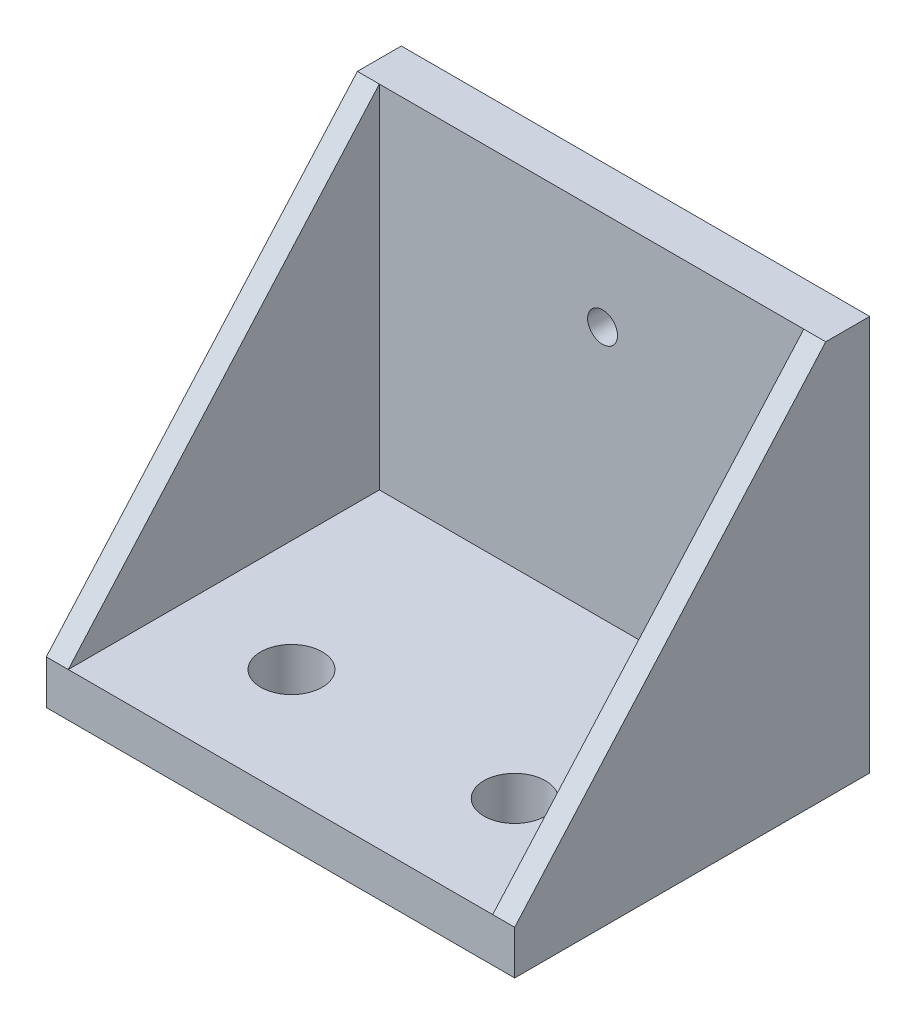
ISO-10303-21;
HEADER;
FILE_DESCRIPTION(('STEP AP214'),'2;1');
FILE_NAME('part.step','',(''),(''),'','','');
FILE_SCHEMA(('AUTOMOTIVE_DESIGN { 1 0 10303 214 1 1 1 1 }'));
ENDSEC;
DATA;
#1=APPLICATION_CONTEXT('core data for automotive mechanical design processes');
#2=APPLICATION_PROTOCOL_DEFINITION('international standard','automotive_design',2000,#1);
#3=PRODUCT_CONTEXT('',#1,'mechanical');
#4=PRODUCT('Part','Part','',(#3));
#5=PRODUCT_RELATED_PRODUCT_CATEGORY('part','',(#4));
#6=PRODUCT_DEFINITION_FORMATION('','',#4);
#7=PRODUCT_DEFINITION_CONTEXT('part definition',#1,'design');
#8=PRODUCT_DEFINITION('design','',#6,#7);
#9=PRODUCT_DEFINITION_SHAPE('','',#8);
#10=(LENGTH_UNIT() NAMED_UNIT(*) SI_UNIT(.MILLI.,.METRE.));
#11=(NAMED_UNIT(*) PLANE_ANGLE_UNIT() SI_UNIT($,.RADIAN.));
#12=(NAMED_UNIT(*) SI_UNIT($,.STERADIAN.) SOLID_ANGLE_UNIT());
#13=UNCERTAINTY_MEASURE_WITH_UNIT(LENGTH_MEASURE(1.E-05),#10,'distance_accuracy_value','');
#14=(GEOMETRIC_REPRESENTATION_CONTEXT(3) GLOBAL_UNCERTAINTY_ASSIGNED_CONTEXT((#13)) GLOBAL_UNIT_ASSIGNED_CONTEXT((#10,
#11,#12)) REPRESENTATION_CONTEXT('',''));
#15=CARTESIAN_POINT('',(0.,0.,0.));
#16=DIRECTION('',(0.,0.,1.));
#17=DIRECTION('',(1.,0.,0.));
#18=AXIS2_PLACEMENT_3D('',#15,#16,#17);
#19=CARTESIAN_POINT('',(0.,5.,0.));
#20=DIRECTION('',(0.,1.,0.));
#21=DIRECTION('',(0.,0.,1.));
#22=AXIS2_PLACEMENT_3D('',#19,#20,#21);
#23=PLANE('',#22);
#24=DIRECTION('',(0.,0.,1.));
#25=VECTOR('',#24,1.);
#26=CARTESIAN_POINT('',(-2.5,5.,0.));
#27=LINE('',#26,#25);
#28=CARTESIAN_POINT('',(-2.5,5.,-35.4));
#29=VERTEX_POINT('',#28);
#30=CARTESIAN_POINT('',(-2.5,5.,0.));
#31=VERTEX_POINT('',#30);
#32=EDGE_CURVE('E159',#29,#31,#27,.T.);
#33=ORIENTED_EDGE('',*,*,#32,.F.);
#34=DIRECTION('',(-1.,0.,0.));
#35=VECTOR('',#34,1.);
#36=CARTESIAN_POINT('',(-50.8,5.,-35.4));
#37=LINE('',#36,#35);
#38=CARTESIAN_POINT('',(-50.8,5.,-35.4));
#39=VERTEX_POINT('',#38);
#40=EDGE_CURVE('E53',#29,#39,#37,.T.);
#41=ORIENTED_EDGE('',*,*,#40,.T.);
#42=DIRECTION('',(0.,0.,1.));
#43=VECTOR('',#42,1.);
#44=CARTESIAN_POINT('',(-50.8,5.,-35.4));
#45=LINE('',#44,#43);
#46=CARTESIAN_POINT('',(-50.8,5.,0.));
#47=VERTEX_POINT('',#46);
#48=EDGE_CURVE('E207',#39,#47,#45,.T.);
#49=ORIENTED_EDGE('',*,*,#48,.T.);
#50=DIRECTION('',(1.,0.,0.));
#51=VECTOR('',#50,1.);
#52=CARTESIAN_POINT('',(-50.8,5.,0.));
#53=LINE('',#52,#51);
#54=EDGE_CURVE('E210',#47,#31,#53,.T.);
#55=ORIENTED_EDGE('',*,*,#54,.T.);
#56=EDGE_LOOP('',(#33,#41,#49,#55));
#57=FACE_BOUND('',#56,.T.);
#58=CARTESIAN_POINT('',(-38.1,5.,-12.7));
#59=DIRECTION('',(0.,1.,0.));
#60=DIRECTION('',(0.,0.,1.));
#61=AXIS2_PLACEMENT_3D('',#58,#59,#60);
#62=CIRCLE('',#61,3.5);
#63=CARTESIAN_POINT('',(-38.1,5.,-9.2));
#64=VERTEX_POINT('',#63);
#65=EDGE_CURVE('E199',#64,#64,#62,.T.);
#66=ORIENTED_EDGE('',*,*,#65,.F.);
#67=EDGE_LOOP('',(#66));
#68=FACE_BOUND('',#67,.T.);
#69=CARTESIAN_POINT('',(-12.7,5.,-12.7));
#70=DIRECTION('',(0.,1.,0.));
#71=DIRECTION('',(0.,0.,1.));
#72=AXIS2_PLACEMENT_3D('',#69,#70,#71);
#73=CIRCLE('',#72,3.5);
#74=CARTESIAN_POINT('',(-12.7,5.,-9.2));
#75=VERTEX_POINT('',#74);
#76=EDGE_CURVE('E191',#75,#75,#73,.T.);
#77=ORIENTED_EDGE('',*,*,#76,.F.);
#78=EDGE_LOOP('',(#77));
#79=FACE_BOUND('',#78,.T.);
#80=ADVANCED_FACE('F43',(#57,#68,#79),#23,.T.);
#81=CARTESIAN_POINT('',(0.,0.,0.));
#82=DIRECTION('',(0.,1.,0.));
#83=DIRECTION('',(0.,0.,1.));
#84=AXIS2_PLACEMENT_3D('',#81,#82,#83);
#85=PLANE('',#84);
#86=DIRECTION('',(1.,0.,0.));
#87=VECTOR('',#86,1.);
#88=CARTESIAN_POINT('',(-50.8,0.,0.));
#89=LINE('',#88,#87);
#90=CARTESIAN_POINT('',(-53.3,0.,0.));
#91=VERTEX_POINT('',#90);
#92=CARTESIAN_POINT('',(0.,0.,0.));
#93=VERTEX_POINT('',#92);
#94=EDGE_CURVE('E203',#91,#93,#89,.T.);
#95=ORIENTED_EDGE('',*,*,#94,.F.);
#96=DIRECTION('',(0.,0.,1.));
#97=VECTOR('',#96,1.);
#98=CARTESIAN_POINT('',(-53.3,0.,-40.4));
#99=LINE('',#98,#97);
#100=CARTESIAN_POINT('',(-53.3,0.,-40.4));
#101=VERTEX_POINT('',#100);
#102=EDGE_CURVE('E230',#101,#91,#99,.T.);
#103=ORIENTED_EDGE('',*,*,#102,.F.);
#104=DIRECTION('',(-1.,0.,0.));
#105=VECTOR('',#104,1.);
#106=CARTESIAN_POINT('',(0.,0.,-40.4));
#107=LINE('',#106,#105);
#108=CARTESIAN_POINT('',(0.,0.,-40.4));
#109=VERTEX_POINT('',#108);
#110=EDGE_CURVE('E175',#109,#101,#107,.T.);
#111=ORIENTED_EDGE('',*,*,#110,.F.);
#112=DIRECTION('',(0.,0.,-1.));
#113=VECTOR('',#112,1.);
#114=CARTESIAN_POINT('',(0.,0.,-35.4));
#115=LINE('',#114,#113);
#116=EDGE_CURVE('E211',#93,#109,#115,.T.);
#117=ORIENTED_EDGE('',*,*,#116,.F.);
#118=EDGE_LOOP('',(#95,#103,#111,#117));
#119=FACE_BOUND('',#118,.T.);
#120=CARTESIAN_POINT('',(-38.1,0.,-12.7));
#121=DIRECTION('',(0.,1.,0.));
#122=DIRECTION('',(0.,0.,1.));
#123=AXIS2_PLACEMENT_3D('',#120,#121,#122);
#124=CIRCLE('',#123,3.5);
#125=CARTESIAN_POINT('',(-38.1,0.,-9.2));
#126=VERTEX_POINT('',#125);
#127=EDGE_CURVE('E195',#126,#126,#124,.T.);
#128=ORIENTED_EDGE('',*,*,#127,.T.);
#129=EDGE_LOOP('',(#128));
#130=FACE_BOUND('',#129,.T.);
#131=CARTESIAN_POINT('',(-12.7,0.,-12.7));
#132=DIRECTION('',(0.,1.,0.));
#133=DIRECTION('',(0.,0.,1.));
#134=AXIS2_PLACEMENT_3D('',#131,#132,#133);
#135=CIRCLE('',#134,3.5);
#136=CARTESIAN_POINT('',(-12.7,0.,-9.2));
#137=VERTEX_POINT('',#136);
#138=EDGE_CURVE('E190',#137,#137,#135,.T.);
#139=ORIENTED_EDGE('',*,*,#138,.T.);
#140=EDGE_LOOP('',(#139));
#141=FACE_BOUND('',#140,.T.);
#142=ADVANCED_FACE('F228',(#119,#130,#141),#85,.F.);
#143=CARTESIAN_POINT('',(-50.8,5.,0.));
#144=DIRECTION('',(0.,0.,-1.));
#145=DIRECTION('',(-1.,0.,0.));
#146=AXIS2_PLACEMENT_3D('',#143,#144,#145);
#147=PLANE('',#146);
#148=ORIENTED_EDGE('',*,*,#94,.T.);
#149=DIRECTION('',(0.,-1.,0.));
#150=VECTOR('',#149,1.);
#151=CARTESIAN_POINT('',(0.,5.,0.));
#152=LINE('',#151,#150);
#153=CARTESIAN_POINT('',(0.,5.,0.));
#154=VERTEX_POINT('',#153);
#155=EDGE_CURVE('E11',#154,#93,#152,.T.);
#156=ORIENTED_EDGE('',*,*,#155,.F.);
#157=DIRECTION('',(1.,0.,0.));
#158=VECTOR('',#157,1.);
#159=CARTESIAN_POINT('',(-2.5,5.,0.));
#160=LINE('',#159,#158);
#161=EDGE_CURVE('E150',#31,#154,#160,.T.);
#162=ORIENTED_EDGE('',*,*,#161,.F.);
#163=ORIENTED_EDGE('',*,*,#54,.F.);
#164=DIRECTION('',(1.,0.,0.));
#165=VECTOR('',#164,1.);
#166=CARTESIAN_POINT('',(-53.3,5.,0.));
#167=LINE('',#166,#165);
#168=CARTESIAN_POINT('',(-53.3,5.,0.));
#169=VERTEX_POINT('',#168);
#170=EDGE_CURVE('E136',#169,#47,#167,.T.);
#171=ORIENTED_EDGE('',*,*,#170,.F.);
#172=DIRECTION('',(0.,1.,0.));
#173=VECTOR('',#172,1.);
#174=CARTESIAN_POINT('',(-53.3,0.,0.));
#175=LINE('',#174,#173);
#176=EDGE_CURVE('E125',#91,#169,#175,.T.);
#177=ORIENTED_EDGE('',*,*,#176,.F.);
#178=EDGE_LOOP('',(#148,#156,#162,#163,#171,#177));
#179=FACE_BOUND('',#178,.T.);
#180=ADVANCED_FACE('F45',(#179),#147,.F.);
#181=CARTESIAN_POINT('',(0.,5.,-35.4));
#182=DIRECTION('',(-1.,0.,0.));
#183=DIRECTION('',(0.,0.,1.));
#184=AXIS2_PLACEMENT_3D('',#181,#182,#183);
#185=PLANE('',#184);
#186=ORIENTED_EDGE('',*,*,#116,.T.);
#187=DIRECTION('',(0.,-1.,0.));
#188=VECTOR('',#187,1.);
#189=CARTESIAN_POINT('',(0.,0.,-40.4));
#190=LINE('',#189,#188);
#191=CARTESIAN_POINT('',(0.,45.,-40.4));
#192=VERTEX_POINT('',#191);
#193=EDGE_CURVE('E171',#192,#109,#190,.T.);
#194=ORIENTED_EDGE('',*,*,#193,.F.);
#195=DIRECTION('',(0.,0.,1.));
#196=VECTOR('',#195,1.);
#197=CARTESIAN_POINT('',(0.,45.,-40.4));
#198=LINE('',#197,#196);
#199=CARTESIAN_POINT('',(0.,45.,-35.4));
#200=VERTEX_POINT('',#199);
#201=EDGE_CURVE('E181',#192,#200,#198,.T.);
#202=ORIENTED_EDGE('',*,*,#201,.T.);
#203=DIRECTION('',(0.,-0.748853610348007,0.662735445157987));
#204=VECTOR('',#203,1.);
#205=CARTESIAN_POINT('',(0.,5.,0.));
#206=LINE('',#205,#204);
#207=EDGE_CURVE('E135',#200,#154,#206,.T.);
#208=ORIENTED_EDGE('',*,*,#207,.T.);
#209=ORIENTED_EDGE('',*,*,#155,.T.);
#210=EDGE_LOOP('',(#186,#194,#202,#208,#209));
#211=FACE_BOUND('',#210,.T.);
#212=ADVANCED_FACE('F224',(#211),#185,.F.);
#213=CARTESIAN_POINT('',(-38.1,5.,-12.7));
#214=DIRECTION('',(0.,-1.,0.));
#215=DIRECTION('',(0.,0.,-1.));
#216=AXIS2_PLACEMENT_3D('',#213,#214,#215);
#217=CYLINDRICAL_SURFACE('',#216,3.5);
#218=ORIENTED_EDGE('',*,*,#65,.T.);
#219=EDGE_LOOP('',(#218));
#220=FACE_BOUND('',#219,.T.);
#221=ORIENTED_EDGE('',*,*,#127,.F.);
#222=EDGE_LOOP('',(#221));
#223=FACE_BOUND('',#222,.T.);
#224=ADVANCED_FACE('F263',(#220,#223),#217,.F.);
#225=CARTESIAN_POINT('',(-12.7,5.,-12.7));
#226=DIRECTION('',(0.,-1.,0.));
#227=DIRECTION('',(0.,0.,-1.));
#228=AXIS2_PLACEMENT_3D('',#225,#226,#227);
#229=CYLINDRICAL_SURFACE('',#228,3.5);
#230=ORIENTED_EDGE('',*,*,#76,.T.);
#231=EDGE_LOOP('',(#230));
#232=FACE_BOUND('',#231,.T.);
#233=ORIENTED_EDGE('',*,*,#138,.F.);
#234=EDGE_LOOP('',(#233));
#235=FACE_BOUND('',#234,.T.);
#236=ADVANCED_FACE('F260',(#232,#235),#229,.F.);
#237=CARTESIAN_POINT('',(0.,0.,-35.4));
#238=DIRECTION('',(0.,0.,1.));
#239=DIRECTION('',(1.,0.,0.));
#240=AXIS2_PLACEMENT_3D('',#237,#238,#239);
#241=PLANE('',#240);
#242=DIRECTION('',(0.,-1.,0.));
#243=VECTOR('',#242,1.);
#244=CARTESIAN_POINT('',(-2.5,0.,-35.4));
#245=LINE('',#244,#243);
#246=CARTESIAN_POINT('',(-2.5,45.,-35.4));
#247=VERTEX_POINT('',#246);
#248=EDGE_CURVE('E153',#247,#29,#245,.T.);
#249=ORIENTED_EDGE('',*,*,#248,.F.);
#250=DIRECTION('',(1.,0.,0.));
#251=VECTOR('',#250,1.);
#252=CARTESIAN_POINT('',(0.,45.,-35.4));
#253=LINE('',#252,#251);
#254=CARTESIAN_POINT('',(-50.8,45.,-35.4));
#255=VERTEX_POINT('',#254);
#256=EDGE_CURVE('E176',#255,#247,#253,.T.);
#257=ORIENTED_EDGE('',*,*,#256,.F.);
#258=DIRECTION('',(0.,1.,0.));
#259=VECTOR('',#258,1.);
#260=CARTESIAN_POINT('',(-50.8,0.,-35.4));
#261=LINE('',#260,#259);
#262=EDGE_CURVE('E167',#39,#255,#261,.T.);
#263=ORIENTED_EDGE('',*,*,#262,.F.);
#264=ORIENTED_EDGE('',*,*,#40,.F.);
#265=EDGE_LOOP('',(#249,#257,#263,#264));
#266=FACE_BOUND('',#265,.T.);
#267=CARTESIAN_POINT('',(-25.4,33.75,-35.4));
#268=DIRECTION('',(0.,0.,-1.));
#269=DIRECTION('',(-1.,0.,0.));
#270=AXIS2_PLACEMENT_3D('',#267,#268,#269);
#271=CIRCLE('',#270,1.7);
#272=CARTESIAN_POINT('',(-27.1,33.75,-35.4));
#273=VERTEX_POINT('',#272);
#274=EDGE_CURVE('E163',#273,#273,#271,.T.);
#275=ORIENTED_EDGE('',*,*,#274,.T.);
#276=EDGE_LOOP('',(#275));
#277=FACE_BOUND('',#276,.T.);
#278=ADVANCED_FACE('F248',(#266,#277),#241,.T.);
#279=CARTESIAN_POINT('',(0.,45.,-40.4));
#280=DIRECTION('',(0.,-1.,0.));
#281=DIRECTION('',(0.,0.,-1.));
#282=AXIS2_PLACEMENT_3D('',#279,#280,#281);
#283=PLANE('',#282);
#284=ORIENTED_EDGE('',*,*,#256,.T.);
#285=DIRECTION('',(1.,0.,0.));
#286=VECTOR('',#285,1.);
#287=CARTESIAN_POINT('',(-2.5,45.,-35.4));
#288=LINE('',#287,#286);
#289=EDGE_CURVE('E148',#247,#200,#288,.T.);
#290=ORIENTED_EDGE('',*,*,#289,.T.);
#291=ORIENTED_EDGE('',*,*,#201,.F.);
#292=DIRECTION('',(1.,0.,0.));
#293=VECTOR('',#292,1.);
#294=CARTESIAN_POINT('',(0.,45.,-40.4));
#295=LINE('',#294,#293);
#296=CARTESIAN_POINT('',(-53.3,45.,-40.4));
#297=VERTEX_POINT('',#296);
#298=EDGE_CURVE('E113',#297,#192,#295,.T.);
#299=ORIENTED_EDGE('',*,*,#298,.F.);
#300=DIRECTION('',(0.,0.,-1.));
#301=VECTOR('',#300,1.);
#302=CARTESIAN_POINT('',(-53.3,45.,-35.4));
#303=LINE('',#302,#301);
#304=CARTESIAN_POINT('',(-53.3,45.,-35.4));
#305=VERTEX_POINT('',#304);
#306=EDGE_CURVE('E105',#305,#297,#303,.T.);
#307=ORIENTED_EDGE('',*,*,#306,.F.);
#308=DIRECTION('',(1.,0.,0.));
#309=VECTOR('',#308,1.);
#310=CARTESIAN_POINT('',(-53.3,45.,-35.4));
#311=LINE('',#310,#309);
#312=EDGE_CURVE('E110',#305,#255,#311,.T.);
#313=ORIENTED_EDGE('',*,*,#312,.T.);
#314=EDGE_LOOP('',(#284,#290,#291,#299,#307,#313));
#315=FACE_BOUND('',#314,.T.);
#316=ADVANCED_FACE('F108',(#315),#283,.F.);
#317=CARTESIAN_POINT('',(0.,0.,-40.4));
#318=DIRECTION('',(0.,0.,1.));
#319=DIRECTION('',(1.,0.,0.));
#320=AXIS2_PLACEMENT_3D('',#317,#318,#319);
#321=PLANE('',#320);
#322=CARTESIAN_POINT('',(-25.4,33.75,-40.4));
#323=DIRECTION('',(0.,0.,-1.));
#324=DIRECTION('',(-1.,0.,0.));
#325=AXIS2_PLACEMENT_3D('',#322,#323,#324);
#326=CIRCLE('',#325,1.7);
#327=CARTESIAN_POINT('',(-27.1,33.75,-40.4));
#328=VERTEX_POINT('',#327);
#329=EDGE_CURVE('E162',#328,#328,#326,.T.);
#330=ORIENTED_EDGE('',*,*,#329,.F.);
#331=EDGE_LOOP('',(#330));
#332=FACE_BOUND('',#331,.T.);
#333=ORIENTED_EDGE('',*,*,#298,.T.);
#334=ORIENTED_EDGE('',*,*,#193,.T.);
#335=ORIENTED_EDGE('',*,*,#110,.T.);
#336=DIRECTION('',(0.,-1.,0.));
#337=VECTOR('',#336,1.);
#338=CARTESIAN_POINT('',(-53.3,45.,-40.4));
#339=LINE('',#338,#337);
#340=EDGE_CURVE('E118',#297,#101,#339,.T.);
#341=ORIENTED_EDGE('',*,*,#340,.F.);
#342=EDGE_LOOP('',(#333,#334,#335,#341));
#343=FACE_BOUND('',#342,.T.);
#344=ADVANCED_FACE('F232',(#332,#343),#321,.F.);
#345=CARTESIAN_POINT('',(-25.4,33.75,-35.4));
#346=DIRECTION('',(0.,0.,-1.));
#347=DIRECTION('',(-1.,0.,0.));
#348=AXIS2_PLACEMENT_3D('',#345,#346,#347);
#349=CYLINDRICAL_SURFACE('',#348,1.7);
#350=ORIENTED_EDGE('',*,*,#274,.F.);
#351=EDGE_LOOP('',(#350));
#352=FACE_BOUND('',#351,.T.);
#353=ORIENTED_EDGE('',*,*,#329,.T.);
#354=EDGE_LOOP('',(#353));
#355=FACE_BOUND('',#354,.T.);
#356=ADVANCED_FACE('F288',(#352,#355),#349,.F.);
#357=CARTESIAN_POINT('',(-2.5,5.,0.));
#358=DIRECTION('',(0.,0.662735445157987,0.748853610348007));
#359=DIRECTION('',(0.,-0.748853610348007,0.662735445157987));
#360=AXIS2_PLACEMENT_3D('',#357,#358,#359);
#361=PLANE('',#360);
#362=ORIENTED_EDGE('',*,*,#207,.F.);
#363=ORIENTED_EDGE('',*,*,#289,.F.);
#364=DIRECTION('',(0.,-0.748853610348007,0.662735445157987));
#365=VECTOR('',#364,1.);
#366=CARTESIAN_POINT('',(-2.5,5.,0.));
#367=LINE('',#366,#365);
#368=EDGE_CURVE('E141',#247,#31,#367,.T.);
#369=ORIENTED_EDGE('',*,*,#368,.T.);
#370=ORIENTED_EDGE('',*,*,#161,.T.);
#371=EDGE_LOOP('',(#362,#363,#369,#370));
#372=FACE_BOUND('',#371,.T.);
#373=ADVANCED_FACE('F292',(#372),#361,.T.);
#374=CARTESIAN_POINT('',(-2.5,0.,0.));
#375=DIRECTION('',(-1.,0.,0.));
#376=DIRECTION('',(0.,0.,1.));
#377=AXIS2_PLACEMENT_3D('',#374,#375,#376);
#378=PLANE('',#377);
#379=ORIENTED_EDGE('',*,*,#248,.T.);
#380=ORIENTED_EDGE('',*,*,#32,.T.);
#381=ORIENTED_EDGE('',*,*,#368,.F.);
#382=EDGE_LOOP('',(#379,#380,#381));
#383=FACE_BOUND('',#382,.T.);
#384=ADVANCED_FACE('F252',(#383),#378,.T.);
#385=CARTESIAN_POINT('',(-53.3,5.,0.));
#386=DIRECTION('',(0.,-0.662735445157986,-0.748853610348008));
#387=DIRECTION('',(0.,0.748853610348008,-0.662735445157986));
#388=AXIS2_PLACEMENT_3D('',#385,#386,#387);
#389=PLANE('',#388);
#390=DIRECTION('',(0.,0.748853610348008,-0.662735445157986));
#391=VECTOR('',#390,1.);
#392=CARTESIAN_POINT('',(-50.8,5.,0.));
#393=LINE('',#392,#391);
#394=EDGE_CURVE('E130',#47,#255,#393,.T.);
#395=ORIENTED_EDGE('',*,*,#394,.T.);
#396=ORIENTED_EDGE('',*,*,#312,.F.);
#397=DIRECTION('',(0.,0.748853610348008,-0.662735445157986));
#398=VECTOR('',#397,1.);
#399=CARTESIAN_POINT('',(-53.3,5.,0.));
#400=LINE('',#399,#398);
#401=EDGE_CURVE('E119',#169,#305,#400,.T.);
#402=ORIENTED_EDGE('',*,*,#401,.F.);
#403=ORIENTED_EDGE('',*,*,#170,.T.);
#404=EDGE_LOOP('',(#395,#396,#402,#403));
#405=FACE_BOUND('',#404,.T.);
#406=ADVANCED_FACE('F132',(#405),#389,.F.);
#407=CARTESIAN_POINT('',(-53.3,0.,0.));
#408=DIRECTION('',(-1.,0.,0.));
#409=DIRECTION('',(0.,0.,1.));
#410=AXIS2_PLACEMENT_3D('',#407,#408,#409);
#411=PLANE('',#410);
#412=ORIENTED_EDGE('',*,*,#401,.T.);
#413=ORIENTED_EDGE('',*,*,#306,.T.);
#414=ORIENTED_EDGE('',*,*,#340,.T.);
#415=ORIENTED_EDGE('',*,*,#102,.T.);
#416=ORIENTED_EDGE('',*,*,#176,.T.);
#417=EDGE_LOOP('',(#412,#413,#414,#415,#416));
#418=FACE_BOUND('',#417,.T.);
#419=ADVANCED_FACE('F122',(#418),#411,.T.);
#420=CARTESIAN_POINT('',(-50.8,0.,0.));
#421=DIRECTION('',(-1.,0.,0.));
#422=DIRECTION('',(0.,0.,1.));
#423=AXIS2_PLACEMENT_3D('',#420,#421,#422);
#424=PLANE('',#423);
#425=ORIENTED_EDGE('',*,*,#48,.F.);
#426=ORIENTED_EDGE('',*,*,#262,.T.);
#427=ORIENTED_EDGE('',*,*,#394,.F.);
#428=EDGE_LOOP('',(#425,#426,#427));
#429=FACE_BOUND('',#428,.T.);
#430=ADVANCED_FACE('F245',(#429),#424,.F.);
#431=CLOSED_SHELL('',(#80,#142,#180,#212,#224,#236,#278,#316,#344,#356,#373,#384,#406,#419,#430));
#432=MANIFOLD_SOLID_BREP('B2',#431);
#433=ADVANCED_BREP_SHAPE_REPRESENTATION('',(#18,#432),#14);
#434=SHAPE_DEFINITION_REPRESENTATION(#9,#433);
ENDSEC;
END-ISO-10303-21;
